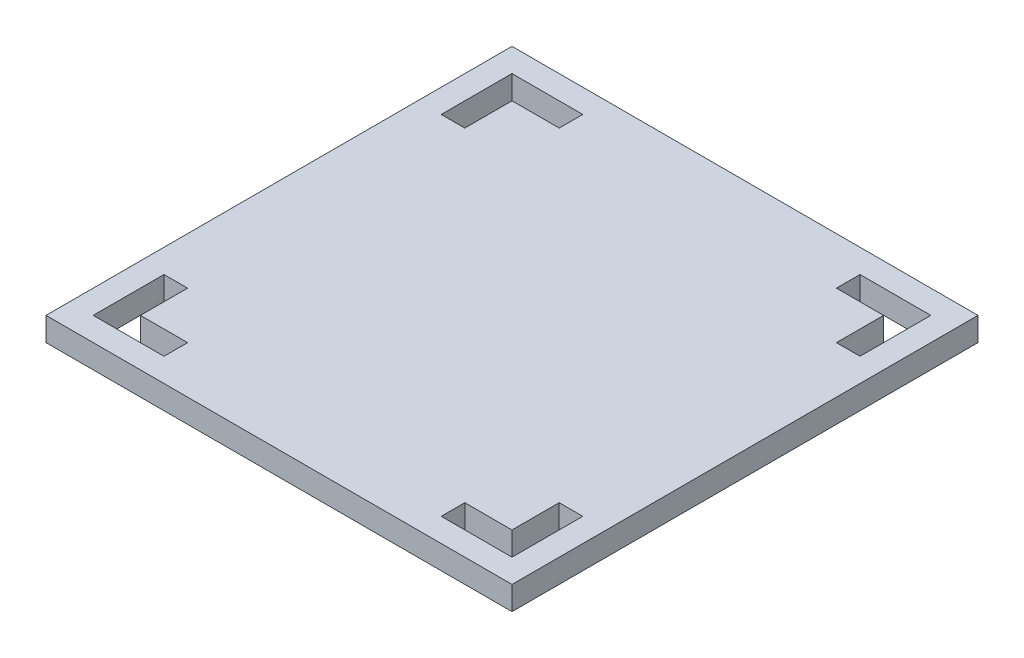
ISO-10303-21;
HEADER;
FILE_DESCRIPTION(('STEP AP214'),'2;1');
FILE_NAME('part.step','',(''),(''),'','','');
FILE_SCHEMA(('AUTOMOTIVE_DESIGN { 1 0 10303 214 1 1 1 1 }'));
ENDSEC;
DATA;
#1=APPLICATION_CONTEXT('core data for automotive mechanical design processes');
#2=APPLICATION_PROTOCOL_DEFINITION('international standard','automotive_design',2000,#1);
#3=PRODUCT_CONTEXT('',#1,'mechanical');
#4=PRODUCT('Part','Part','',(#3));
#5=PRODUCT_RELATED_PRODUCT_CATEGORY('part','',(#4));
#6=PRODUCT_DEFINITION_FORMATION('','',#4);
#7=PRODUCT_DEFINITION_CONTEXT('part definition',#1,'design');
#8=PRODUCT_DEFINITION('design','',#6,#7);
#9=PRODUCT_DEFINITION_SHAPE('','',#8);
#10=(LENGTH_UNIT() NAMED_UNIT(*) SI_UNIT(.MILLI.,.METRE.));
#11=(NAMED_UNIT(*) PLANE_ANGLE_UNIT() SI_UNIT($,.RADIAN.));
#12=(NAMED_UNIT(*) SI_UNIT($,.STERADIAN.) SOLID_ANGLE_UNIT());
#13=UNCERTAINTY_MEASURE_WITH_UNIT(LENGTH_MEASURE(1.E-05),#10,'distance_accuracy_value','');
#14=(GEOMETRIC_REPRESENTATION_CONTEXT(3) GLOBAL_UNCERTAINTY_ASSIGNED_CONTEXT((#13)) GLOBAL_UNIT_ASSIGNED_CONTEXT((#10,
#11,#12)) REPRESENTATION_CONTEXT('',''));
#15=CARTESIAN_POINT('',(0.,0.,0.));
#16=DIRECTION('',(0.,0.,1.));
#17=DIRECTION('',(1.,0.,0.));
#18=AXIS2_PLACEMENT_3D('',#15,#16,#17);
#19=CARTESIAN_POINT('',(62.7,6.35,62.7));
#20=DIRECTION('',(-1.,0.,0.));
#21=DIRECTION('',(0.,0.,1.));
#22=AXIS2_PLACEMENT_3D('',#19,#20,#21);
#23=PLANE('',#22);
#24=DIRECTION('',(0.,0.,-1.));
#25=VECTOR('',#24,1.);
#26=CARTESIAN_POINT('',(62.7,0.,62.7));
#27=LINE('',#26,#25);
#28=CARTESIAN_POINT('',(62.7,0.,62.7));
#29=VERTEX_POINT('',#28);
#30=CARTESIAN_POINT('',(62.7,0.,-62.7));
#31=VERTEX_POINT('',#30);
#32=EDGE_CURVE('E430',#29,#31,#27,.T.);
#33=ORIENTED_EDGE('',*,*,#32,.T.);
#34=DIRECTION('',(0.,-1.,0.));
#35=VECTOR('',#34,1.);
#36=CARTESIAN_POINT('',(62.7,6.35,-62.7));
#37=LINE('',#36,#35);
#38=CARTESIAN_POINT('',(62.7,6.35,-62.7));
#39=VERTEX_POINT('',#38);
#40=EDGE_CURVE('E11',#39,#31,#37,.T.);
#41=ORIENTED_EDGE('',*,*,#40,.F.);
#42=DIRECTION('',(0.,0.,-1.));
#43=VECTOR('',#42,1.);
#44=CARTESIAN_POINT('',(62.7,6.35,62.7));
#45=LINE('',#44,#43);
#46=CARTESIAN_POINT('',(62.7,6.35,62.7));
#47=VERTEX_POINT('',#46);
#48=EDGE_CURVE('E434',#47,#39,#45,.T.);
#49=ORIENTED_EDGE('',*,*,#48,.F.);
#50=DIRECTION('',(0.,-1.,0.));
#51=VECTOR('',#50,1.);
#52=CARTESIAN_POINT('',(62.7,6.35,62.7));
#53=LINE('',#52,#51);
#54=EDGE_CURVE('E440',#47,#29,#53,.T.);
#55=ORIENTED_EDGE('',*,*,#54,.T.);
#56=EDGE_LOOP('',(#33,#41,#49,#55));
#57=FACE_BOUND('',#56,.T.);
#58=ADVANCED_FACE('F32',(#57),#23,.F.);
#59=CARTESIAN_POINT('',(-62.7,6.35,-62.7));
#60=DIRECTION('',(0.,0.,1.));
#61=DIRECTION('',(1.,0.,0.));
#62=AXIS2_PLACEMENT_3D('',#59,#60,#61);
#63=PLANE('',#62);
#64=DIRECTION('',(-1.,0.,0.));
#65=VECTOR('',#64,1.);
#66=CARTESIAN_POINT('',(-62.7,0.,-62.7));
#67=LINE('',#66,#65);
#68=CARTESIAN_POINT('',(-62.7,0.,-62.7));
#69=VERTEX_POINT('',#68);
#70=EDGE_CURVE('E443',#31,#69,#67,.T.);
#71=ORIENTED_EDGE('',*,*,#70,.T.);
#72=DIRECTION('',(0.,-1.,0.));
#73=VECTOR('',#72,1.);
#74=CARTESIAN_POINT('',(-62.7,6.35,-62.7));
#75=LINE('',#74,#73);
#76=CARTESIAN_POINT('',(-62.7,6.35,-62.7));
#77=VERTEX_POINT('',#76);
#78=EDGE_CURVE('E40',#77,#69,#75,.T.);
#79=ORIENTED_EDGE('',*,*,#78,.F.);
#80=DIRECTION('',(-1.,0.,0.));
#81=VECTOR('',#80,1.);
#82=CARTESIAN_POINT('',(-62.7,6.35,-62.7));
#83=LINE('',#82,#81);
#84=EDGE_CURVE('E79',#39,#77,#83,.T.);
#85=ORIENTED_EDGE('',*,*,#84,.F.);
#86=ORIENTED_EDGE('',*,*,#40,.T.);
#87=EDGE_LOOP('',(#71,#79,#85,#86));
#88=FACE_BOUND('',#87,.T.);
#89=ADVANCED_FACE('F467',(#88),#63,.F.);
#90=CARTESIAN_POINT('',(-62.7,6.35,62.7));
#91=DIRECTION('',(1.,0.,0.));
#92=DIRECTION('',(0.,0.,-1.));
#93=AXIS2_PLACEMENT_3D('',#90,#91,#92);
#94=PLANE('',#93);
#95=DIRECTION('',(0.,0.,1.));
#96=VECTOR('',#95,1.);
#97=CARTESIAN_POINT('',(-62.7,0.,62.7));
#98=LINE('',#97,#96);
#99=CARTESIAN_POINT('',(-62.7,0.,62.7));
#100=VERTEX_POINT('',#99);
#101=EDGE_CURVE('E66',#69,#100,#98,.T.);
#102=ORIENTED_EDGE('',*,*,#101,.T.);
#103=DIRECTION('',(0.,-1.,0.));
#104=VECTOR('',#103,1.);
#105=CARTESIAN_POINT('',(-62.7,6.35,62.7));
#106=LINE('',#105,#104);
#107=CARTESIAN_POINT('',(-62.7,6.35,62.7));
#108=VERTEX_POINT('',#107);
#109=EDGE_CURVE('E448',#108,#100,#106,.T.);
#110=ORIENTED_EDGE('',*,*,#109,.F.);
#111=DIRECTION('',(0.,0.,1.));
#112=VECTOR('',#111,1.);
#113=CARTESIAN_POINT('',(-62.7,6.35,62.7));
#114=LINE('',#113,#112);
#115=EDGE_CURVE('E437',#77,#108,#114,.T.);
#116=ORIENTED_EDGE('',*,*,#115,.F.);
#117=ORIENTED_EDGE('',*,*,#78,.T.);
#118=EDGE_LOOP('',(#102,#110,#116,#117));
#119=FACE_BOUND('',#118,.T.);
#120=ADVANCED_FACE('F450',(#119),#94,.F.);
#121=CARTESIAN_POINT('',(-62.7,6.35,62.7));
#122=DIRECTION('',(0.,0.,-1.));
#123=DIRECTION('',(-1.,0.,0.));
#124=AXIS2_PLACEMENT_3D('',#121,#122,#123);
#125=PLANE('',#124);
#126=DIRECTION('',(1.,0.,0.));
#127=VECTOR('',#126,1.);
#128=CARTESIAN_POINT('',(-62.7,0.,62.7));
#129=LINE('',#128,#127);
#130=EDGE_CURVE('E72',#100,#29,#129,.T.);
#131=ORIENTED_EDGE('',*,*,#130,.T.);
#132=ORIENTED_EDGE('',*,*,#54,.F.);
#133=DIRECTION('',(1.,0.,0.));
#134=VECTOR('',#133,1.);
#135=CARTESIAN_POINT('',(-62.7,6.35,62.7));
#136=LINE('',#135,#134);
#137=EDGE_CURVE('E48',#108,#47,#136,.T.);
#138=ORIENTED_EDGE('',*,*,#137,.F.);
#139=ORIENTED_EDGE('',*,*,#109,.T.);
#140=EDGE_LOOP('',(#131,#132,#138,#139));
#141=FACE_BOUND('',#140,.T.);
#142=ADVANCED_FACE('F456',(#141),#125,.F.);
#143=CARTESIAN_POINT('',(0.,6.35,0.));
#144=DIRECTION('',(0.,-1.,0.));
#145=DIRECTION('',(0.,0.,-1.));
#146=AXIS2_PLACEMENT_3D('',#143,#144,#145);
#147=PLANE('',#146);
#148=DIRECTION('',(-1.,0.,0.));
#149=VECTOR('',#148,1.);
#150=CARTESIAN_POINT('',(49.9999999999994,6.35,-56.3500000000005));
#151=LINE('',#150,#149);
#152=CARTESIAN_POINT('',(56.3499999999994,6.35,-56.3500000000006));
#153=VERTEX_POINT('',#152);
#154=CARTESIAN_POINT('',(37.2999999999994,6.35,-56.3500000000004));
#155=VERTEX_POINT('',#154);
#156=EDGE_CURVE('E326',#153,#155,#151,.T.);
#157=ORIENTED_EDGE('',*,*,#156,.F.);
#158=DIRECTION('',(0.,0.,-1.));
#159=VECTOR('',#158,1.);
#160=CARTESIAN_POINT('',(56.3499999999994,6.35,-56.3500000000006));
#161=LINE('',#160,#159);
#162=CARTESIAN_POINT('',(56.3499999999996,6.35,-37.3000000000006));
#163=VERTEX_POINT('',#162);
#164=EDGE_CURVE('E252',#163,#153,#161,.T.);
#165=ORIENTED_EDGE('',*,*,#164,.F.);
#166=DIRECTION('',(1.,0.,0.));
#167=VECTOR('',#166,1.);
#168=CARTESIAN_POINT('',(49.9999999999996,6.35,-37.3000000000005));
#169=LINE('',#168,#167);
#170=CARTESIAN_POINT('',(49.9999999999996,6.35,-37.3000000000005));
#171=VERTEX_POINT('',#170);
#172=EDGE_CURVE('E255',#171,#163,#169,.T.);
#173=ORIENTED_EDGE('',*,*,#172,.F.);
#174=DIRECTION('',(0.,0.,1.));
#175=VECTOR('',#174,1.);
#176=CARTESIAN_POINT('',(49.9999999999994,6.35,-56.3500000000005));
#177=LINE('',#176,#175);
#178=CARTESIAN_POINT('',(49.9999999999995,6.35,-50.0000000000005));
#179=VERTEX_POINT('',#178);
#180=EDGE_CURVE('E232',#179,#171,#177,.T.);
#181=ORIENTED_EDGE('',*,*,#180,.F.);
#182=DIRECTION('',(1.,0.,0.));
#183=VECTOR('',#182,1.);
#184=CARTESIAN_POINT('',(49.9999999999995,6.35,-50.0000000000005));
#185=LINE('',#184,#183);
#186=CARTESIAN_POINT('',(37.2999999999995,6.35,-50.0000000000004));
#187=VERTEX_POINT('',#186);
#188=EDGE_CURVE('E311',#187,#179,#185,.T.);
#189=ORIENTED_EDGE('',*,*,#188,.F.);
#190=DIRECTION('',(0.,0.,1.));
#191=VECTOR('',#190,1.);
#192=CARTESIAN_POINT('',(37.2999999999995,6.35,-50.0000000000004));
#193=LINE('',#192,#191);
#194=EDGE_CURVE('E318',#155,#187,#193,.T.);
#195=ORIENTED_EDGE('',*,*,#194,.F.);
#196=EDGE_LOOP('',(#157,#165,#173,#181,#189,#195));
#197=FACE_BOUND('',#196,.T.);
#198=DIRECTION('',(0.,0.,-1.));
#199=VECTOR('',#198,1.);
#200=CARTESIAN_POINT('',(56.35,6.35,50.));
#201=LINE('',#200,#199);
#202=CARTESIAN_POINT('',(56.35,6.35,56.35));
#203=VERTEX_POINT('',#202);
#204=CARTESIAN_POINT('',(56.35,6.35,37.3));
#205=VERTEX_POINT('',#204);
#206=EDGE_CURVE('E350',#203,#205,#201,.T.);
#207=ORIENTED_EDGE('',*,*,#206,.F.);
#208=DIRECTION('',(1.,0.,0.));
#209=VECTOR('',#208,1.);
#210=CARTESIAN_POINT('',(56.35,6.35,56.35));
#211=LINE('',#210,#209);
#212=CARTESIAN_POINT('',(37.3,6.35,56.35));
#213=VERTEX_POINT('',#212);
#214=EDGE_CURVE('E270',#213,#203,#211,.T.);
#215=ORIENTED_EDGE('',*,*,#214,.F.);
#216=DIRECTION('',(0.,0.,1.));
#217=VECTOR('',#216,1.);
#218=CARTESIAN_POINT('',(37.3,6.35,50.));
#219=LINE('',#218,#217);
#220=CARTESIAN_POINT('',(37.3,6.35,50.));
#221=VERTEX_POINT('',#220);
#222=EDGE_CURVE('E278',#221,#213,#219,.T.);
#223=ORIENTED_EDGE('',*,*,#222,.F.);
#224=DIRECTION('',(-1.,0.,0.));
#225=VECTOR('',#224,1.);
#226=CARTESIAN_POINT('',(56.35,6.35,50.));
#227=LINE('',#226,#225);
#228=CARTESIAN_POINT('',(50.,6.35,50.));
#229=VERTEX_POINT('',#228);
#230=EDGE_CURVE('E264',#229,#221,#227,.T.);
#231=ORIENTED_EDGE('',*,*,#230,.F.);
#232=DIRECTION('',(0.,0.,1.));
#233=VECTOR('',#232,1.);
#234=CARTESIAN_POINT('',(50.,6.35,50.));
#235=LINE('',#234,#233);
#236=CARTESIAN_POINT('',(50.,6.35,37.3));
#237=VERTEX_POINT('',#236);
#238=EDGE_CURVE('E333',#237,#229,#235,.T.);
#239=ORIENTED_EDGE('',*,*,#238,.F.);
#240=DIRECTION('',(-1.,0.,0.));
#241=VECTOR('',#240,1.);
#242=CARTESIAN_POINT('',(50.,6.35,37.3));
#243=LINE('',#242,#241);
#244=EDGE_CURVE('E341',#205,#237,#243,.T.);
#245=ORIENTED_EDGE('',*,*,#244,.F.);
#246=EDGE_LOOP('',(#207,#215,#223,#231,#239,#245));
#247=FACE_BOUND('',#246,.T.);
#248=DIRECTION('',(1.,0.,0.));
#249=VECTOR('',#248,1.);
#250=CARTESIAN_POINT('',(-49.9999999999998,6.35,56.3500000000002));
#251=LINE('',#250,#249);
#252=CARTESIAN_POINT('',(-56.3499999999998,6.35,56.3500000000002));
#253=VERTEX_POINT('',#252);
#254=CARTESIAN_POINT('',(-37.2999999999998,6.35,56.3500000000001));
#255=VERTEX_POINT('',#254);
#256=EDGE_CURVE('E374',#253,#255,#251,.T.);
#257=ORIENTED_EDGE('',*,*,#256,.F.);
#258=DIRECTION('',(0.,0.,1.));
#259=VECTOR('',#258,1.);
#260=CARTESIAN_POINT('',(-56.3499999999998,6.35,56.3500000000002));
#261=LINE('',#260,#259);
#262=CARTESIAN_POINT('',(-56.3499999999999,6.35,37.3000000000002));
#263=VERTEX_POINT('',#262);
#264=EDGE_CURVE('E295',#263,#253,#261,.T.);
#265=ORIENTED_EDGE('',*,*,#264,.F.);
#266=DIRECTION('',(-1.,0.,0.));
#267=VECTOR('',#266,1.);
#268=CARTESIAN_POINT('',(-49.9999999999999,6.35,37.3000000000002));
#269=LINE('',#268,#267);
#270=CARTESIAN_POINT('',(-49.9999999999999,6.35,37.3000000000002));
#271=VERTEX_POINT('',#270);
#272=EDGE_CURVE('E303',#271,#263,#269,.T.);
#273=ORIENTED_EDGE('',*,*,#272,.F.);
#274=DIRECTION('',(0.,0.,-1.));
#275=VECTOR('',#274,1.);
#276=CARTESIAN_POINT('',(-49.9999999999998,6.35,56.3500000000002));
#277=LINE('',#276,#275);
#278=CARTESIAN_POINT('',(-49.9999999999998,6.35,50.0000000000002));
#279=VERTEX_POINT('',#278);
#280=EDGE_CURVE('E286',#279,#271,#277,.T.);
#281=ORIENTED_EDGE('',*,*,#280,.F.);
#282=DIRECTION('',(-1.,0.,0.));
#283=VECTOR('',#282,1.);
#284=CARTESIAN_POINT('',(-49.9999999999998,6.35,50.0000000000002));
#285=LINE('',#284,#283);
#286=CARTESIAN_POINT('',(-37.2999999999998,6.35,50.0000000000001));
#287=VERTEX_POINT('',#286);
#288=EDGE_CURVE('E357',#287,#279,#285,.T.);
#289=ORIENTED_EDGE('',*,*,#288,.F.);
#290=DIRECTION('',(0.,0.,-1.));
#291=VECTOR('',#290,1.);
#292=CARTESIAN_POINT('',(-37.2999999999998,6.35,50.0000000000001));
#293=LINE('',#292,#291);
#294=EDGE_CURVE('E365',#255,#287,#293,.T.);
#295=ORIENTED_EDGE('',*,*,#294,.F.);
#296=EDGE_LOOP('',(#257,#265,#273,#281,#289,#295));
#297=FACE_BOUND('',#296,.T.);
#298=DIRECTION('',(0.,0.,1.));
#299=VECTOR('',#298,1.);
#300=CARTESIAN_POINT('',(-56.35,6.35,-50.));
#301=LINE('',#300,#299);
#302=CARTESIAN_POINT('',(-56.35,6.35,-56.35));
#303=VERTEX_POINT('',#302);
#304=CARTESIAN_POINT('',(-56.35,6.35,-37.3));
#305=VERTEX_POINT('',#304);
#306=EDGE_CURVE('E423',#303,#305,#301,.T.);
#307=ORIENTED_EDGE('',*,*,#306,.F.);
#308=DIRECTION('',(-1.,0.,0.));
#309=VECTOR('',#308,1.);
#310=CARTESIAN_POINT('',(-56.35,6.35,-56.35));
#311=LINE('',#310,#309);
#312=CARTESIAN_POINT('',(-37.3,6.35,-56.35));
#313=VERTEX_POINT('',#312);
#314=EDGE_CURVE('E389',#313,#303,#311,.T.);
#315=ORIENTED_EDGE('',*,*,#314,.F.);
#316=DIRECTION('',(0.,0.,-1.));
#317=VECTOR('',#316,1.);
#318=CARTESIAN_POINT('',(-37.3,6.35,-50.));
#319=LINE('',#318,#317);
#320=CARTESIAN_POINT('',(-37.3,6.35,-50.));
#321=VERTEX_POINT('',#320);
#322=EDGE_CURVE('E397',#321,#313,#319,.T.);
#323=ORIENTED_EDGE('',*,*,#322,.F.);
#324=DIRECTION('',(1.,0.,0.));
#325=VECTOR('',#324,1.);
#326=CARTESIAN_POINT('',(-56.35,6.35,-50.));
#327=LINE('',#326,#325);
#328=CARTESIAN_POINT('',(-50.,6.35,-50.));
#329=VERTEX_POINT('',#328);
#330=EDGE_CURVE('E381',#329,#321,#327,.T.);
#331=ORIENTED_EDGE('',*,*,#330,.F.);
#332=DIRECTION('',(0.,0.,-1.));
#333=VECTOR('',#332,1.);
#334=CARTESIAN_POINT('',(-50.,6.35,-50.));
#335=LINE('',#334,#333);
#336=CARTESIAN_POINT('',(-50.,6.35,-37.3));
#337=VERTEX_POINT('',#336);
#338=EDGE_CURVE('E405',#337,#329,#335,.T.);
#339=ORIENTED_EDGE('',*,*,#338,.F.);
#340=DIRECTION('',(1.,0.,0.));
#341=VECTOR('',#340,1.);
#342=CARTESIAN_POINT('',(-50.,6.35,-37.3));
#343=LINE('',#342,#341);
#344=EDGE_CURVE('E414',#305,#337,#343,.T.);
#345=ORIENTED_EDGE('',*,*,#344,.F.);
#346=EDGE_LOOP('',(#307,#315,#323,#331,#339,#345));
#347=FACE_BOUND('',#346,.T.);
#348=ORIENTED_EDGE('',*,*,#48,.T.);
#349=ORIENTED_EDGE('',*,*,#84,.T.);
#350=ORIENTED_EDGE('',*,*,#115,.T.);
#351=ORIENTED_EDGE('',*,*,#137,.T.);
#352=EDGE_LOOP('',(#348,#349,#350,#351));
#353=FACE_BOUND('',#352,.T.);
#354=ADVANCED_FACE('F458',(#197,#247,#297,#347,#353),#147,.F.);
#355=CARTESIAN_POINT('',(0.,0.,0.));
#356=DIRECTION('',(0.,-1.,0.));
#357=DIRECTION('',(0.,0.,-1.));
#358=AXIS2_PLACEMENT_3D('',#355,#356,#357);
#359=PLANE('',#358);
#360=DIRECTION('',(0.,0.,-1.));
#361=VECTOR('',#360,1.);
#362=CARTESIAN_POINT('',(56.3499999999994,0.,-56.3500000000006));
#363=LINE('',#362,#361);
#364=CARTESIAN_POINT('',(56.3499999999996,0.,-37.3000000000006));
#365=VERTEX_POINT('',#364);
#366=CARTESIAN_POINT('',(56.3499999999994,0.,-56.3500000000006));
#367=VERTEX_POINT('',#366);
#368=EDGE_CURVE('E237',#365,#367,#363,.T.);
#369=ORIENTED_EDGE('',*,*,#368,.T.);
#370=DIRECTION('',(-1.,0.,0.));
#371=VECTOR('',#370,1.);
#372=CARTESIAN_POINT('',(49.9999999999994,0.,-56.3500000000005));
#373=LINE('',#372,#371);
#374=CARTESIAN_POINT('',(37.2999999999994,0.,-56.3500000000004));
#375=VERTEX_POINT('',#374);
#376=EDGE_CURVE('E317',#367,#375,#373,.T.);
#377=ORIENTED_EDGE('',*,*,#376,.T.);
#378=DIRECTION('',(0.,0.,1.));
#379=VECTOR('',#378,1.);
#380=CARTESIAN_POINT('',(37.2999999999995,0.,-50.0000000000004));
#381=LINE('',#380,#379);
#382=CARTESIAN_POINT('',(37.2999999999995,0.,-50.0000000000004));
#383=VERTEX_POINT('',#382);
#384=EDGE_CURVE('E321',#375,#383,#381,.T.);
#385=ORIENTED_EDGE('',*,*,#384,.T.);
#386=DIRECTION('',(1.,0.,0.));
#387=VECTOR('',#386,1.);
#388=CARTESIAN_POINT('',(49.9999999999995,0.,-50.0000000000005));
#389=LINE('',#388,#387);
#390=CARTESIAN_POINT('',(49.9999999999995,0.,-50.0000000000005));
#391=VERTEX_POINT('',#390);
#392=EDGE_CURVE('E251',#383,#391,#389,.T.);
#393=ORIENTED_EDGE('',*,*,#392,.T.);
#394=DIRECTION('',(0.,0.,1.));
#395=VECTOR('',#394,1.);
#396=CARTESIAN_POINT('',(49.9999999999994,0.,-56.3500000000005));
#397=LINE('',#396,#395);
#398=CARTESIAN_POINT('',(49.9999999999996,0.,-37.3000000000005));
#399=VERTEX_POINT('',#398);
#400=EDGE_CURVE('E229',#391,#399,#397,.T.);
#401=ORIENTED_EDGE('',*,*,#400,.T.);
#402=DIRECTION('',(1.,0.,0.));
#403=VECTOR('',#402,1.);
#404=CARTESIAN_POINT('',(49.9999999999996,0.,-37.3000000000005));
#405=LINE('',#404,#403);
#406=EDGE_CURVE('E240',#399,#365,#405,.T.);
#407=ORIENTED_EDGE('',*,*,#406,.T.);
#408=EDGE_LOOP('',(#369,#377,#385,#393,#401,#407));
#409=FACE_BOUND('',#408,.T.);
#410=DIRECTION('',(1.,0.,0.));
#411=VECTOR('',#410,1.);
#412=CARTESIAN_POINT('',(56.35,0.,56.35));
#413=LINE('',#412,#411);
#414=CARTESIAN_POINT('',(37.3,0.,56.35));
#415=VERTEX_POINT('',#414);
#416=CARTESIAN_POINT('',(56.35,0.,56.35));
#417=VERTEX_POINT('',#416);
#418=EDGE_CURVE('E273',#415,#417,#413,.T.);
#419=ORIENTED_EDGE('',*,*,#418,.T.);
#420=DIRECTION('',(0.,0.,-1.));
#421=VECTOR('',#420,1.);
#422=CARTESIAN_POINT('',(56.35,0.,50.));
#423=LINE('',#422,#421);
#424=CARTESIAN_POINT('',(56.35,0.,37.3));
#425=VERTEX_POINT('',#424);
#426=EDGE_CURVE('E340',#417,#425,#423,.T.);
#427=ORIENTED_EDGE('',*,*,#426,.T.);
#428=DIRECTION('',(-1.,0.,0.));
#429=VECTOR('',#428,1.);
#430=CARTESIAN_POINT('',(50.,0.,37.3));
#431=LINE('',#430,#429);
#432=CARTESIAN_POINT('',(50.,0.,37.3));
#433=VERTEX_POINT('',#432);
#434=EDGE_CURVE('E344',#425,#433,#431,.T.);
#435=ORIENTED_EDGE('',*,*,#434,.T.);
#436=DIRECTION('',(0.,0.,1.));
#437=VECTOR('',#436,1.);
#438=CARTESIAN_POINT('',(50.,0.,50.));
#439=LINE('',#438,#437);
#440=CARTESIAN_POINT('',(50.,0.,50.));
#441=VERTEX_POINT('',#440);
#442=EDGE_CURVE('E337',#433,#441,#439,.T.);
#443=ORIENTED_EDGE('',*,*,#442,.T.);
#444=DIRECTION('',(-1.,0.,0.));
#445=VECTOR('',#444,1.);
#446=CARTESIAN_POINT('',(56.35,0.,50.));
#447=LINE('',#446,#445);
#448=CARTESIAN_POINT('',(37.3,0.,50.));
#449=VERTEX_POINT('',#448);
#450=EDGE_CURVE('E266',#441,#449,#447,.T.);
#451=ORIENTED_EDGE('',*,*,#450,.T.);
#452=DIRECTION('',(0.,0.,1.));
#453=VECTOR('',#452,1.);
#454=CARTESIAN_POINT('',(37.3,0.,50.));
#455=LINE('',#454,#453);
#456=EDGE_CURVE('E269',#449,#415,#455,.T.);
#457=ORIENTED_EDGE('',*,*,#456,.T.);
#458=EDGE_LOOP('',(#419,#427,#435,#443,#451,#457));
#459=FACE_BOUND('',#458,.T.);
#460=DIRECTION('',(0.,0.,1.));
#461=VECTOR('',#460,1.);
#462=CARTESIAN_POINT('',(-56.3499999999998,0.,56.3500000000002));
#463=LINE('',#462,#461);
#464=CARTESIAN_POINT('',(-56.3499999999999,0.,37.3000000000002));
#465=VERTEX_POINT('',#464);
#466=CARTESIAN_POINT('',(-56.3499999999998,0.,56.3500000000002));
#467=VERTEX_POINT('',#466);
#468=EDGE_CURVE('E298',#465,#467,#463,.T.);
#469=ORIENTED_EDGE('',*,*,#468,.T.);
#470=DIRECTION('',(1.,0.,0.));
#471=VECTOR('',#470,1.);
#472=CARTESIAN_POINT('',(-49.9999999999998,0.,56.3500000000002));
#473=LINE('',#472,#471);
#474=CARTESIAN_POINT('',(-37.2999999999998,0.,56.3500000000001));
#475=VERTEX_POINT('',#474);
#476=EDGE_CURVE('E364',#467,#475,#473,.T.);
#477=ORIENTED_EDGE('',*,*,#476,.T.);
#478=DIRECTION('',(0.,0.,-1.));
#479=VECTOR('',#478,1.);
#480=CARTESIAN_POINT('',(-37.2999999999998,0.,50.0000000000001));
#481=LINE('',#480,#479);
#482=CARTESIAN_POINT('',(-37.2999999999998,0.,50.0000000000001));
#483=VERTEX_POINT('',#482);
#484=EDGE_CURVE('E368',#475,#483,#481,.T.);
#485=ORIENTED_EDGE('',*,*,#484,.T.);
#486=DIRECTION('',(-1.,0.,0.));
#487=VECTOR('',#486,1.);
#488=CARTESIAN_POINT('',(-49.9999999999998,0.,50.0000000000002));
#489=LINE('',#488,#487);
#490=CARTESIAN_POINT('',(-49.9999999999998,0.,50.0000000000002));
#491=VERTEX_POINT('',#490);
#492=EDGE_CURVE('E361',#483,#491,#489,.T.);
#493=ORIENTED_EDGE('',*,*,#492,.T.);
#494=DIRECTION('',(0.,0.,-1.));
#495=VECTOR('',#494,1.);
#496=CARTESIAN_POINT('',(-49.9999999999998,0.,56.3500000000002));
#497=LINE('',#496,#495);
#498=CARTESIAN_POINT('',(-49.9999999999999,0.,37.3000000000002));
#499=VERTEX_POINT('',#498);
#500=EDGE_CURVE('E291',#491,#499,#497,.T.);
#501=ORIENTED_EDGE('',*,*,#500,.T.);
#502=DIRECTION('',(-1.,0.,0.));
#503=VECTOR('',#502,1.);
#504=CARTESIAN_POINT('',(-49.9999999999999,0.,37.3000000000002));
#505=LINE('',#504,#503);
#506=EDGE_CURVE('E294',#499,#465,#505,.T.);
#507=ORIENTED_EDGE('',*,*,#506,.T.);
#508=EDGE_LOOP('',(#469,#477,#485,#493,#501,#507));
#509=FACE_BOUND('',#508,.T.);
#510=DIRECTION('',(-1.,0.,0.));
#511=VECTOR('',#510,1.);
#512=CARTESIAN_POINT('',(-56.35,0.,-56.35));
#513=LINE('',#512,#511);
#514=CARTESIAN_POINT('',(-37.3,0.,-56.35));
#515=VERTEX_POINT('',#514);
#516=CARTESIAN_POINT('',(-56.35,0.,-56.35));
#517=VERTEX_POINT('',#516);
#518=EDGE_CURVE('E392',#515,#517,#513,.T.);
#519=ORIENTED_EDGE('',*,*,#518,.T.);
#520=DIRECTION('',(0.,0.,1.));
#521=VECTOR('',#520,1.);
#522=CARTESIAN_POINT('',(-56.35,0.,-50.));
#523=LINE('',#522,#521);
#524=CARTESIAN_POINT('',(-56.35,0.,-37.3));
#525=VERTEX_POINT('',#524);
#526=EDGE_CURVE('E413',#517,#525,#523,.T.);
#527=ORIENTED_EDGE('',*,*,#526,.T.);
#528=DIRECTION('',(1.,0.,0.));
#529=VECTOR('',#528,1.);
#530=CARTESIAN_POINT('',(-50.,0.,-37.3));
#531=LINE('',#530,#529);
#532=CARTESIAN_POINT('',(-50.,0.,-37.3));
#533=VERTEX_POINT('',#532);
#534=EDGE_CURVE('E417',#525,#533,#531,.T.);
#535=ORIENTED_EDGE('',*,*,#534,.T.);
#536=DIRECTION('',(0.,0.,-1.));
#537=VECTOR('',#536,1.);
#538=CARTESIAN_POINT('',(-50.,0.,-50.));
#539=LINE('',#538,#537);
#540=CARTESIAN_POINT('',(-50.,0.,-50.));
#541=VERTEX_POINT('',#540);
#542=EDGE_CURVE('E410',#533,#541,#539,.T.);
#543=ORIENTED_EDGE('',*,*,#542,.T.);
#544=DIRECTION('',(1.,0.,0.));
#545=VECTOR('',#544,1.);
#546=CARTESIAN_POINT('',(-56.35,0.,-50.));
#547=LINE('',#546,#545);
#548=CARTESIAN_POINT('',(-37.3,0.,-50.));
#549=VERTEX_POINT('',#548);
#550=EDGE_CURVE('E385',#541,#549,#547,.T.);
#551=ORIENTED_EDGE('',*,*,#550,.T.);
#552=DIRECTION('',(0.,0.,-1.));
#553=VECTOR('',#552,1.);
#554=CARTESIAN_POINT('',(-37.3,0.,-50.));
#555=LINE('',#554,#553);
#556=EDGE_CURVE('E388',#549,#515,#555,.T.);
#557=ORIENTED_EDGE('',*,*,#556,.T.);
#558=EDGE_LOOP('',(#519,#527,#535,#543,#551,#557));
#559=FACE_BOUND('',#558,.T.);
#560=ORIENTED_EDGE('',*,*,#32,.F.);
#561=ORIENTED_EDGE('',*,*,#130,.F.);
#562=ORIENTED_EDGE('',*,*,#101,.F.);
#563=ORIENTED_EDGE('',*,*,#70,.F.);
#564=EDGE_LOOP('',(#560,#561,#562,#563));
#565=FACE_BOUND('',#564,.T.);
#566=ADVANCED_FACE('F247',(#409,#459,#509,#559,#565),#359,.T.);
#567=CARTESIAN_POINT('',(-50.,0.,-50.));
#568=DIRECTION('',(1.,0.,0.));
#569=DIRECTION('',(0.,0.,-1.));
#570=AXIS2_PLACEMENT_3D('',#567,#568,#569);
#571=PLANE('',#570);
#572=ORIENTED_EDGE('',*,*,#338,.T.);
#573=DIRECTION('',(0.,1.,0.));
#574=VECTOR('',#573,1.);
#575=CARTESIAN_POINT('',(-50.,0.,-50.));
#576=LINE('',#575,#574);
#577=EDGE_CURVE('E420',#541,#329,#576,.T.);
#578=ORIENTED_EDGE('',*,*,#577,.F.);
#579=ORIENTED_EDGE('',*,*,#542,.F.);
#580=DIRECTION('',(0.,1.,0.));
#581=VECTOR('',#580,1.);
#582=CARTESIAN_POINT('',(-50.,0.,-37.3));
#583=LINE('',#582,#581);
#584=EDGE_CURVE('E428',#533,#337,#583,.T.);
#585=ORIENTED_EDGE('',*,*,#584,.T.);
#586=EDGE_LOOP('',(#572,#578,#579,#585));
#587=FACE_BOUND('',#586,.T.);
#588=ADVANCED_FACE('F496',(#587),#571,.F.);
#589=CARTESIAN_POINT('',(-50.,0.,-37.3));
#590=DIRECTION('',(0.,0.,1.));
#591=DIRECTION('',(1.,0.,0.));
#592=AXIS2_PLACEMENT_3D('',#589,#590,#591);
#593=PLANE('',#592);
#594=ORIENTED_EDGE('',*,*,#344,.T.);
#595=ORIENTED_EDGE('',*,*,#584,.F.);
#596=ORIENTED_EDGE('',*,*,#534,.F.);
#597=DIRECTION('',(0.,1.,0.));
#598=VECTOR('',#597,1.);
#599=CARTESIAN_POINT('',(-56.35,0.,-37.3));
#600=LINE('',#599,#598);
#601=EDGE_CURVE('E431',#525,#305,#600,.T.);
#602=ORIENTED_EDGE('',*,*,#601,.T.);
#603=EDGE_LOOP('',(#594,#595,#596,#602));
#604=FACE_BOUND('',#603,.T.);
#605=ADVANCED_FACE('F490',(#604),#593,.F.);
#606=CARTESIAN_POINT('',(-56.35,0.,-50.));
#607=DIRECTION('',(-1.,0.,0.));
#608=DIRECTION('',(0.,0.,1.));
#609=AXIS2_PLACEMENT_3D('',#606,#607,#608);
#610=PLANE('',#609);
#611=ORIENTED_EDGE('',*,*,#306,.T.);
#612=ORIENTED_EDGE('',*,*,#601,.F.);
#613=ORIENTED_EDGE('',*,*,#526,.F.);
#614=DIRECTION('',(0.,1.,0.));
#615=VECTOR('',#614,1.);
#616=CARTESIAN_POINT('',(-56.35,0.,-56.35));
#617=LINE('',#616,#615);
#618=EDGE_CURVE('E402',#517,#303,#617,.T.);
#619=ORIENTED_EDGE('',*,*,#618,.T.);
#620=EDGE_LOOP('',(#611,#612,#613,#619));
#621=FACE_BOUND('',#620,.T.);
#622=ADVANCED_FACE('F495',(#621),#610,.F.);
#623=CARTESIAN_POINT('',(-56.35,0.,-50.));
#624=DIRECTION('',(0.,0.,1.));
#625=DIRECTION('',(1.,0.,0.));
#626=AXIS2_PLACEMENT_3D('',#623,#624,#625);
#627=PLANE('',#626);
#628=ORIENTED_EDGE('',*,*,#330,.T.);
#629=DIRECTION('',(0.,1.,0.));
#630=VECTOR('',#629,1.);
#631=CARTESIAN_POINT('',(-37.3,0.,-50.));
#632=LINE('',#631,#630);
#633=EDGE_CURVE('E395',#549,#321,#632,.T.);
#634=ORIENTED_EDGE('',*,*,#633,.F.);
#635=ORIENTED_EDGE('',*,*,#550,.F.);
#636=ORIENTED_EDGE('',*,*,#577,.T.);
#637=EDGE_LOOP('',(#628,#634,#635,#636));
#638=FACE_BOUND('',#637,.T.);
#639=ADVANCED_FACE('F518',(#638),#627,.F.);
#640=CARTESIAN_POINT('',(-56.35,0.,-56.35));
#641=DIRECTION('',(0.,0.,-1.));
#642=DIRECTION('',(-1.,0.,0.));
#643=AXIS2_PLACEMENT_3D('',#640,#641,#642);
#644=PLANE('',#643);
#645=ORIENTED_EDGE('',*,*,#314,.T.);
#646=ORIENTED_EDGE('',*,*,#618,.F.);
#647=ORIENTED_EDGE('',*,*,#518,.F.);
#648=DIRECTION('',(0.,1.,0.));
#649=VECTOR('',#648,1.);
#650=CARTESIAN_POINT('',(-37.3,0.,-56.35));
#651=LINE('',#650,#649);
#652=EDGE_CURVE('E406',#515,#313,#651,.T.);
#653=ORIENTED_EDGE('',*,*,#652,.T.);
#654=EDGE_LOOP('',(#645,#646,#647,#653));
#655=FACE_BOUND('',#654,.T.);
#656=ADVANCED_FACE('F528',(#655),#644,.F.);
#657=CARTESIAN_POINT('',(-37.3,0.,-50.));
#658=DIRECTION('',(1.,0.,0.));
#659=DIRECTION('',(0.,0.,-1.));
#660=AXIS2_PLACEMENT_3D('',#657,#658,#659);
#661=PLANE('',#660);
#662=ORIENTED_EDGE('',*,*,#322,.T.);
#663=ORIENTED_EDGE('',*,*,#652,.F.);
#664=ORIENTED_EDGE('',*,*,#556,.F.);
#665=ORIENTED_EDGE('',*,*,#633,.T.);
#666=EDGE_LOOP('',(#662,#663,#664,#665));
#667=FACE_BOUND('',#666,.T.);
#668=ADVANCED_FACE('F538',(#667),#661,.F.);
#669=CARTESIAN_POINT('',(-49.9999999999998,0.,50.0000000000002));
#670=DIRECTION('',(0.,0.,-1.));
#671=DIRECTION('',(-1.,0.,0.));
#672=AXIS2_PLACEMENT_3D('',#669,#670,#671);
#673=PLANE('',#672);
#674=ORIENTED_EDGE('',*,*,#288,.T.);
#675=DIRECTION('',(0.,1.,0.));
#676=VECTOR('',#675,1.);
#677=CARTESIAN_POINT('',(-49.9999999999998,0.,50.0000000000002));
#678=LINE('',#677,#676);
#679=EDGE_CURVE('E371',#491,#279,#678,.T.);
#680=ORIENTED_EDGE('',*,*,#679,.F.);
#681=ORIENTED_EDGE('',*,*,#492,.F.);
#682=DIRECTION('',(0.,1.,0.));
#683=VECTOR('',#682,1.);
#684=CARTESIAN_POINT('',(-37.2999999999998,0.,50.0000000000001));
#685=LINE('',#684,#683);
#686=EDGE_CURVE('E379',#483,#287,#685,.T.);
#687=ORIENTED_EDGE('',*,*,#686,.T.);
#688=EDGE_LOOP('',(#674,#680,#681,#687));
#689=FACE_BOUND('',#688,.T.);
#690=ADVANCED_FACE('F548',(#689),#673,.F.);
#691=CARTESIAN_POINT('',(-37.2999999999998,0.,50.0000000000001));
#692=DIRECTION('',(1.,0.,0.));
#693=DIRECTION('',(0.,0.,-1.));
#694=AXIS2_PLACEMENT_3D('',#691,#692,#693);
#695=PLANE('',#694);
#696=ORIENTED_EDGE('',*,*,#294,.T.);
#697=ORIENTED_EDGE('',*,*,#686,.F.);
#698=ORIENTED_EDGE('',*,*,#484,.F.);
#699=DIRECTION('',(0.,1.,0.));
#700=VECTOR('',#699,1.);
#701=CARTESIAN_POINT('',(-37.2999999999998,0.,56.3500000000001));
#702=LINE('',#701,#700);
#703=EDGE_CURVE('E382',#475,#255,#702,.T.);
#704=ORIENTED_EDGE('',*,*,#703,.T.);
#705=EDGE_LOOP('',(#696,#697,#698,#704));
#706=FACE_BOUND('',#705,.T.);
#707=ADVANCED_FACE('F556',(#706),#695,.F.);
#708=CARTESIAN_POINT('',(-49.9999999999998,0.,56.3500000000002));
#709=DIRECTION('',(0.,0.,1.));
#710=DIRECTION('',(1.,0.,0.));
#711=AXIS2_PLACEMENT_3D('',#708,#709,#710);
#712=PLANE('',#711);
#713=ORIENTED_EDGE('',*,*,#256,.T.);
#714=ORIENTED_EDGE('',*,*,#703,.F.);
#715=ORIENTED_EDGE('',*,*,#476,.F.);
#716=DIRECTION('',(0.,1.,0.));
#717=VECTOR('',#716,1.);
#718=CARTESIAN_POINT('',(-56.3499999999998,0.,56.3500000000002));
#719=LINE('',#718,#717);
#720=EDGE_CURVE('E308',#467,#253,#719,.T.);
#721=ORIENTED_EDGE('',*,*,#720,.T.);
#722=EDGE_LOOP('',(#713,#714,#715,#721));
#723=FACE_BOUND('',#722,.T.);
#724=ADVANCED_FACE('F561',(#723),#712,.F.);
#725=CARTESIAN_POINT('',(50.,0.,50.));
#726=DIRECTION('',(-1.,0.,0.));
#727=DIRECTION('',(0.,0.,1.));
#728=AXIS2_PLACEMENT_3D('',#725,#726,#727);
#729=PLANE('',#728);
#730=ORIENTED_EDGE('',*,*,#238,.T.);
#731=DIRECTION('',(0.,1.,0.));
#732=VECTOR('',#731,1.);
#733=CARTESIAN_POINT('',(50.,0.,50.));
#734=LINE('',#733,#732);
#735=EDGE_CURVE('E347',#441,#229,#734,.T.);
#736=ORIENTED_EDGE('',*,*,#735,.F.);
#737=ORIENTED_EDGE('',*,*,#442,.F.);
#738=DIRECTION('',(0.,1.,0.));
#739=VECTOR('',#738,1.);
#740=CARTESIAN_POINT('',(50.,0.,37.3));
#741=LINE('',#740,#739);
#742=EDGE_CURVE('E355',#433,#237,#741,.T.);
#743=ORIENTED_EDGE('',*,*,#742,.T.);
#744=EDGE_LOOP('',(#730,#736,#737,#743));
#745=FACE_BOUND('',#744,.T.);
#746=ADVANCED_FACE('F575',(#745),#729,.F.);
#747=CARTESIAN_POINT('',(50.,0.,37.3));
#748=DIRECTION('',(0.,0.,-1.));
#749=DIRECTION('',(-1.,0.,0.));
#750=AXIS2_PLACEMENT_3D('',#747,#748,#749);
#751=PLANE('',#750);
#752=ORIENTED_EDGE('',*,*,#244,.T.);
#753=ORIENTED_EDGE('',*,*,#742,.F.);
#754=ORIENTED_EDGE('',*,*,#434,.F.);
#755=DIRECTION('',(0.,1.,0.));
#756=VECTOR('',#755,1.);
#757=CARTESIAN_POINT('',(56.35,0.,37.3));
#758=LINE('',#757,#756);
#759=EDGE_CURVE('E358',#425,#205,#758,.T.);
#760=ORIENTED_EDGE('',*,*,#759,.T.);
#761=EDGE_LOOP('',(#752,#753,#754,#760));
#762=FACE_BOUND('',#761,.T.);
#763=ADVANCED_FACE('F569',(#762),#751,.F.);
#764=CARTESIAN_POINT('',(56.35,0.,50.));
#765=DIRECTION('',(1.,0.,0.));
#766=DIRECTION('',(0.,0.,-1.));
#767=AXIS2_PLACEMENT_3D('',#764,#765,#766);
#768=PLANE('',#767);
#769=ORIENTED_EDGE('',*,*,#206,.T.);
#770=ORIENTED_EDGE('',*,*,#759,.F.);
#771=ORIENTED_EDGE('',*,*,#426,.F.);
#772=DIRECTION('',(0.,1.,0.));
#773=VECTOR('',#772,1.);
#774=CARTESIAN_POINT('',(56.35,0.,56.35));
#775=LINE('',#774,#773);
#776=EDGE_CURVE('E283',#417,#203,#775,.T.);
#777=ORIENTED_EDGE('',*,*,#776,.T.);
#778=EDGE_LOOP('',(#769,#770,#771,#777));
#779=FACE_BOUND('',#778,.T.);
#780=ADVANCED_FACE('F574',(#779),#768,.F.);
#781=CARTESIAN_POINT('',(49.9999999999995,0.,-50.0000000000005));
#782=DIRECTION('',(0.,0.,1.));
#783=DIRECTION('',(1.,0.,0.));
#784=AXIS2_PLACEMENT_3D('',#781,#782,#783);
#785=PLANE('',#784);
#786=ORIENTED_EDGE('',*,*,#188,.T.);
#787=DIRECTION('',(0.,1.,0.));
#788=VECTOR('',#787,1.);
#789=CARTESIAN_POINT('',(49.9999999999995,0.,-50.0000000000005));
#790=LINE('',#789,#788);
#791=EDGE_CURVE('E323',#391,#179,#790,.T.);
#792=ORIENTED_EDGE('',*,*,#791,.F.);
#793=ORIENTED_EDGE('',*,*,#392,.F.);
#794=DIRECTION('',(0.,1.,0.));
#795=VECTOR('',#794,1.);
#796=CARTESIAN_POINT('',(37.2999999999995,0.,-50.0000000000004));
#797=LINE('',#796,#795);
#798=EDGE_CURVE('E331',#383,#187,#797,.T.);
#799=ORIENTED_EDGE('',*,*,#798,.T.);
#800=EDGE_LOOP('',(#786,#792,#793,#799));
#801=FACE_BOUND('',#800,.T.);
#802=ADVANCED_FACE('F590',(#801),#785,.F.);
#803=CARTESIAN_POINT('',(37.2999999999995,0.,-50.0000000000004));
#804=DIRECTION('',(-1.,0.,0.));
#805=DIRECTION('',(0.,0.,1.));
#806=AXIS2_PLACEMENT_3D('',#803,#804,#805);
#807=PLANE('',#806);
#808=ORIENTED_EDGE('',*,*,#194,.T.);
#809=ORIENTED_EDGE('',*,*,#798,.F.);
#810=ORIENTED_EDGE('',*,*,#384,.F.);
#811=DIRECTION('',(0.,1.,0.));
#812=VECTOR('',#811,1.);
#813=CARTESIAN_POINT('',(37.2999999999994,0.,-56.3500000000004));
#814=LINE('',#813,#812);
#815=EDGE_CURVE('E334',#375,#155,#814,.T.);
#816=ORIENTED_EDGE('',*,*,#815,.T.);
#817=EDGE_LOOP('',(#808,#809,#810,#816));
#818=FACE_BOUND('',#817,.T.);
#819=ADVANCED_FACE('F585',(#818),#807,.F.);
#820=CARTESIAN_POINT('',(49.9999999999994,0.,-56.3500000000005));
#821=DIRECTION('',(0.,0.,-1.));
#822=DIRECTION('',(-1.,0.,0.));
#823=AXIS2_PLACEMENT_3D('',#820,#821,#822);
#824=PLANE('',#823);
#825=ORIENTED_EDGE('',*,*,#156,.T.);
#826=ORIENTED_EDGE('',*,*,#815,.F.);
#827=ORIENTED_EDGE('',*,*,#376,.F.);
#828=DIRECTION('',(0.,1.,0.));
#829=VECTOR('',#828,1.);
#830=CARTESIAN_POINT('',(56.3499999999994,0.,-56.3500000000006));
#831=LINE('',#830,#829);
#832=EDGE_CURVE('E261',#367,#153,#831,.T.);
#833=ORIENTED_EDGE('',*,*,#832,.T.);
#834=EDGE_LOOP('',(#825,#826,#827,#833));
#835=FACE_BOUND('',#834,.T.);
#836=ADVANCED_FACE('F589',(#835),#824,.F.);
#837=CARTESIAN_POINT('',(-49.9999999999998,0.,56.3500000000002));
#838=DIRECTION('',(1.,0.,0.));
#839=DIRECTION('',(0.,0.,-1.));
#840=AXIS2_PLACEMENT_3D('',#837,#838,#839);
#841=PLANE('',#840);
#842=ORIENTED_EDGE('',*,*,#280,.T.);
#843=DIRECTION('',(0.,1.,0.));
#844=VECTOR('',#843,1.);
#845=CARTESIAN_POINT('',(-49.9999999999999,0.,37.3000000000002));
#846=LINE('',#845,#844);
#847=EDGE_CURVE('E301',#499,#271,#846,.T.);
#848=ORIENTED_EDGE('',*,*,#847,.F.);
#849=ORIENTED_EDGE('',*,*,#500,.F.);
#850=ORIENTED_EDGE('',*,*,#679,.T.);
#851=EDGE_LOOP('',(#842,#848,#849,#850));
#852=FACE_BOUND('',#851,.T.);
#853=ADVANCED_FACE('F646',(#852),#841,.F.);
#854=CARTESIAN_POINT('',(-56.3499999999998,0.,56.3500000000002));
#855=DIRECTION('',(-1.,0.,0.));
#856=DIRECTION('',(0.,0.,1.));
#857=AXIS2_PLACEMENT_3D('',#854,#855,#856);
#858=PLANE('',#857);
#859=ORIENTED_EDGE('',*,*,#264,.T.);
#860=ORIENTED_EDGE('',*,*,#720,.F.);
#861=ORIENTED_EDGE('',*,*,#468,.F.);
#862=DIRECTION('',(0.,1.,0.));
#863=VECTOR('',#862,1.);
#864=CARTESIAN_POINT('',(-56.3499999999999,0.,37.3000000000002));
#865=LINE('',#864,#863);
#866=EDGE_CURVE('E312',#465,#263,#865,.T.);
#867=ORIENTED_EDGE('',*,*,#866,.T.);
#868=EDGE_LOOP('',(#859,#860,#861,#867));
#869=FACE_BOUND('',#868,.T.);
#870=ADVANCED_FACE('F656',(#869),#858,.F.);
#871=CARTESIAN_POINT('',(-49.9999999999999,0.,37.3000000000002));
#872=DIRECTION('',(0.,0.,-1.));
#873=DIRECTION('',(-1.,0.,0.));
#874=AXIS2_PLACEMENT_3D('',#871,#872,#873);
#875=PLANE('',#874);
#876=ORIENTED_EDGE('',*,*,#272,.T.);
#877=ORIENTED_EDGE('',*,*,#866,.F.);
#878=ORIENTED_EDGE('',*,*,#506,.F.);
#879=ORIENTED_EDGE('',*,*,#847,.T.);
#880=EDGE_LOOP('',(#876,#877,#878,#879));
#881=FACE_BOUND('',#880,.T.);
#882=ADVANCED_FACE('F666',(#881),#875,.F.);
#883=CARTESIAN_POINT('',(56.35,0.,50.));
#884=DIRECTION('',(0.,0.,-1.));
#885=DIRECTION('',(-1.,0.,0.));
#886=AXIS2_PLACEMENT_3D('',#883,#884,#885);
#887=PLANE('',#886);
#888=ORIENTED_EDGE('',*,*,#230,.T.);
#889=DIRECTION('',(0.,1.,0.));
#890=VECTOR('',#889,1.);
#891=CARTESIAN_POINT('',(37.3,0.,50.));
#892=LINE('',#891,#890);
#893=EDGE_CURVE('E276',#449,#221,#892,.T.);
#894=ORIENTED_EDGE('',*,*,#893,.F.);
#895=ORIENTED_EDGE('',*,*,#450,.F.);
#896=ORIENTED_EDGE('',*,*,#735,.T.);
#897=EDGE_LOOP('',(#888,#894,#895,#896));
#898=FACE_BOUND('',#897,.T.);
#899=ADVANCED_FACE('F676',(#898),#887,.F.);
#900=CARTESIAN_POINT('',(56.35,0.,56.35));
#901=DIRECTION('',(0.,0.,1.));
#902=DIRECTION('',(1.,0.,0.));
#903=AXIS2_PLACEMENT_3D('',#900,#901,#902);
#904=PLANE('',#903);
#905=ORIENTED_EDGE('',*,*,#214,.T.);
#906=ORIENTED_EDGE('',*,*,#776,.F.);
#907=ORIENTED_EDGE('',*,*,#418,.F.);
#908=DIRECTION('',(0.,1.,0.));
#909=VECTOR('',#908,1.);
#910=CARTESIAN_POINT('',(37.3,0.,56.35));
#911=LINE('',#910,#909);
#912=EDGE_CURVE('E287',#415,#213,#911,.T.);
#913=ORIENTED_EDGE('',*,*,#912,.T.);
#914=EDGE_LOOP('',(#905,#906,#907,#913));
#915=FACE_BOUND('',#914,.T.);
#916=ADVANCED_FACE('F686',(#915),#904,.F.);
#917=CARTESIAN_POINT('',(37.3,0.,50.));
#918=DIRECTION('',(-1.,0.,0.));
#919=DIRECTION('',(0.,0.,1.));
#920=AXIS2_PLACEMENT_3D('',#917,#918,#919);
#921=PLANE('',#920);
#922=ORIENTED_EDGE('',*,*,#222,.T.);
#923=ORIENTED_EDGE('',*,*,#912,.F.);
#924=ORIENTED_EDGE('',*,*,#456,.F.);
#925=ORIENTED_EDGE('',*,*,#893,.T.);
#926=EDGE_LOOP('',(#922,#923,#924,#925));
#927=FACE_BOUND('',#926,.T.);
#928=ADVANCED_FACE('F696',(#927),#921,.F.);
#929=CARTESIAN_POINT('',(49.9999999999994,0.,-56.3500000000005));
#930=DIRECTION('',(-1.,0.,0.));
#931=DIRECTION('',(0.,0.,1.));
#932=AXIS2_PLACEMENT_3D('',#929,#930,#931);
#933=PLANE('',#932);
#934=ORIENTED_EDGE('',*,*,#180,.T.);
#935=DIRECTION('',(0.,1.,0.));
#936=VECTOR('',#935,1.);
#937=CARTESIAN_POINT('',(49.9999999999996,0.,-37.3000000000005));
#938=LINE('',#937,#936);
#939=EDGE_CURVE('E225',#399,#171,#938,.T.);
#940=ORIENTED_EDGE('',*,*,#939,.F.);
#941=ORIENTED_EDGE('',*,*,#400,.F.);
#942=ORIENTED_EDGE('',*,*,#791,.T.);
#943=EDGE_LOOP('',(#934,#940,#941,#942));
#944=FACE_BOUND('',#943,.T.);
#945=ADVANCED_FACE('F227',(#944),#933,.F.);
#946=CARTESIAN_POINT('',(56.3499999999994,0.,-56.3500000000006));
#947=DIRECTION('',(1.,0.,0.));
#948=DIRECTION('',(0.,0.,-1.));
#949=AXIS2_PLACEMENT_3D('',#946,#947,#948);
#950=PLANE('',#949);
#951=ORIENTED_EDGE('',*,*,#164,.T.);
#952=ORIENTED_EDGE('',*,*,#832,.F.);
#953=ORIENTED_EDGE('',*,*,#368,.F.);
#954=DIRECTION('',(0.,1.,0.));
#955=VECTOR('',#954,1.);
#956=CARTESIAN_POINT('',(56.3499999999996,0.,-37.3000000000006));
#957=LINE('',#956,#955);
#958=EDGE_CURVE('E236',#365,#163,#957,.T.);
#959=ORIENTED_EDGE('',*,*,#958,.T.);
#960=EDGE_LOOP('',(#951,#952,#953,#959));
#961=FACE_BOUND('',#960,.T.);
#962=ADVANCED_FACE('F715',(#961),#950,.F.);
#963=CARTESIAN_POINT('',(49.9999999999996,0.,-37.3000000000005));
#964=DIRECTION('',(0.,0.,1.));
#965=DIRECTION('',(1.,0.,0.));
#966=AXIS2_PLACEMENT_3D('',#963,#964,#965);
#967=PLANE('',#966);
#968=ORIENTED_EDGE('',*,*,#172,.T.);
#969=ORIENTED_EDGE('',*,*,#958,.F.);
#970=ORIENTED_EDGE('',*,*,#406,.F.);
#971=ORIENTED_EDGE('',*,*,#939,.T.);
#972=EDGE_LOOP('',(#968,#969,#970,#971));
#973=FACE_BOUND('',#972,.T.);
#974=ADVANCED_FACE('F241',(#973),#967,.F.);
#975=CLOSED_SHELL('',(#58,#89,#120,#142,#354,#566,#588,#605,#622,#639,#656,#668,#690,#707,#724,
#746,#763,#780,#802,#819,#836,#853,#870,#882,#899,#916,#928,#945,#962,#974));
#976=MANIFOLD_SOLID_BREP('B2',#975);
#977=ADVANCED_BREP_SHAPE_REPRESENTATION('',(#18,#976),#14);
#978=SHAPE_DEFINITION_REPRESENTATION(#9,#977);
ENDSEC;
END-ISO-10303-21;
